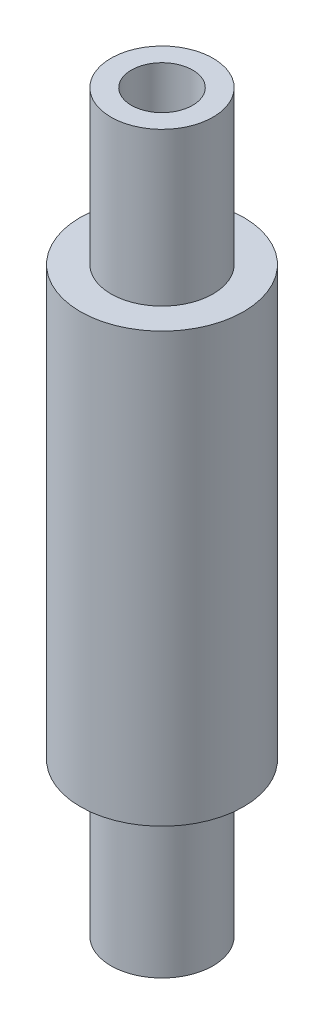
ISO-10303-21;
HEADER;
FILE_DESCRIPTION(('STEP AP214'),'2;1');
FILE_NAME('part.step','',(''),(''),'','','');
FILE_SCHEMA(('AUTOMOTIVE_DESIGN { 1 0 10303 214 1 1 1 1 }'));
ENDSEC;
DATA;
#1=APPLICATION_CONTEXT('core data for automotive mechanical design processes');
#2=APPLICATION_PROTOCOL_DEFINITION('international standard','automotive_design',2000,#1);
#3=PRODUCT_CONTEXT('',#1,'mechanical');
#4=PRODUCT('Part','Part','',(#3));
#5=PRODUCT_RELATED_PRODUCT_CATEGORY('part','',(#4));
#6=PRODUCT_DEFINITION_FORMATION('','',#4);
#7=PRODUCT_DEFINITION_CONTEXT('part definition',#1,'design');
#8=PRODUCT_DEFINITION('design','',#6,#7);
#9=PRODUCT_DEFINITION_SHAPE('','',#8);
#10=(LENGTH_UNIT() NAMED_UNIT(*) SI_UNIT(.MILLI.,.METRE.));
#11=(NAMED_UNIT(*) PLANE_ANGLE_UNIT() SI_UNIT($,.RADIAN.));
#12=(NAMED_UNIT(*) SI_UNIT($,.STERADIAN.) SOLID_ANGLE_UNIT());
#13=UNCERTAINTY_MEASURE_WITH_UNIT(LENGTH_MEASURE(1.E-05),#10,'distance_accuracy_value','');
#14=(GEOMETRIC_REPRESENTATION_CONTEXT(3) GLOBAL_UNCERTAINTY_ASSIGNED_CONTEXT((#13)) GLOBAL_UNIT_ASSIGNED_CONTEXT((#10,
#11,#12)) REPRESENTATION_CONTEXT('',''));
#15=CARTESIAN_POINT('',(0.,0.,0.));
#16=DIRECTION('',(0.,0.,1.));
#17=DIRECTION('',(1.,0.,0.));
#18=AXIS2_PLACEMENT_3D('',#15,#16,#17);
#19=CARTESIAN_POINT('',(0.,21.,0.));
#20=DIRECTION('',(0.,1.,0.));
#21=DIRECTION('',(0.,0.,1.));
#22=AXIS2_PLACEMENT_3D('',#19,#20,#21);
#23=PLANE('',#22);
#24=CARTESIAN_POINT('',(0.,21.,0.));
#25=DIRECTION('',(0.,1.,0.));
#26=DIRECTION('',(0.,0.,1.));
#27=AXIS2_PLACEMENT_3D('',#24,#25,#26);
#28=CIRCLE('',#27,2.5);
#29=CARTESIAN_POINT('',(0.,21.,2.5));
#30=VERTEX_POINT('',#29);
#31=EDGE_CURVE('E57',#30,#30,#28,.T.);
#32=ORIENTED_EDGE('',*,*,#31,.F.);
#33=EDGE_LOOP('',(#32));
#34=FACE_BOUND('',#33,.T.);
#35=CARTESIAN_POINT('',(0.,21.,0.));
#36=DIRECTION('',(0.,1.,0.));
#37=DIRECTION('',(0.,0.,1.));
#38=AXIS2_PLACEMENT_3D('',#35,#36,#37);
#39=CIRCLE('',#38,4.);
#40=CARTESIAN_POINT('',(0.,21.,4.));
#41=VERTEX_POINT('',#40);
#42=EDGE_CURVE('E43',#41,#41,#39,.T.);
#43=ORIENTED_EDGE('',*,*,#42,.T.);
#44=EDGE_LOOP('',(#43));
#45=FACE_BOUND('',#44,.T.);
#46=ADVANCED_FACE('F36',(#34,#45),#23,.T.);
#47=CARTESIAN_POINT('',(0.,0.,0.));
#48=DIRECTION('',(0.,1.,0.));
#49=DIRECTION('',(0.,0.,1.));
#50=AXIS2_PLACEMENT_3D('',#47,#48,#49);
#51=PLANE('',#50);
#52=CARTESIAN_POINT('',(0.,0.,0.));
#53=DIRECTION('',(0.,1.,0.));
#54=DIRECTION('',(0.,0.,1.));
#55=AXIS2_PLACEMENT_3D('',#52,#53,#54);
#56=CIRCLE('',#55,2.5);
#57=CARTESIAN_POINT('',(0.,0.,2.5));
#58=VERTEX_POINT('',#57);
#59=EDGE_CURVE('E10',#58,#58,#56,.F.);
#60=ORIENTED_EDGE('',*,*,#59,.F.);
#61=EDGE_LOOP('',(#60));
#62=FACE_BOUND('',#61,.T.);
#63=CARTESIAN_POINT('',(0.,0.,0.));
#64=DIRECTION('',(0.,1.,0.));
#65=DIRECTION('',(0.,0.,1.));
#66=AXIS2_PLACEMENT_3D('',#63,#64,#65);
#67=CIRCLE('',#66,4.);
#68=CARTESIAN_POINT('',(0.,0.,4.));
#69=VERTEX_POINT('',#68);
#70=EDGE_CURVE('E47',#69,#69,#67,.T.);
#71=ORIENTED_EDGE('',*,*,#70,.F.);
#72=EDGE_LOOP('',(#71));
#73=FACE_BOUND('',#72,.T.);
#74=ADVANCED_FACE('F91',(#62,#73),#51,.F.);
#75=CARTESIAN_POINT('',(0.,21.,0.));
#76=DIRECTION('',(0.,-1.,0.));
#77=DIRECTION('',(0.,0.,-1.));
#78=AXIS2_PLACEMENT_3D('',#75,#76,#77);
#79=CYLINDRICAL_SURFACE('',#78,4.);
#80=ORIENTED_EDGE('',*,*,#42,.F.);
#81=EDGE_LOOP('',(#80));
#82=FACE_BOUND('',#81,.T.);
#83=ORIENTED_EDGE('',*,*,#70,.T.);
#84=EDGE_LOOP('',(#83));
#85=FACE_BOUND('',#84,.T.);
#86=ADVANCED_FACE('F38',(#82,#85),#79,.T.);
#87=CARTESIAN_POINT('',(0.,-7.5,0.));
#88=DIRECTION('',(0.,1.,0.));
#89=DIRECTION('',(0.,0.,1.));
#90=AXIS2_PLACEMENT_3D('',#87,#88,#89);
#91=CYLINDRICAL_SURFACE('',#90,2.5);
#92=CARTESIAN_POINT('',(0.,-7.5,0.));
#93=DIRECTION('',(0.,-1.,0.));
#94=DIRECTION('',(0.,0.,-1.));
#95=AXIS2_PLACEMENT_3D('',#92,#93,#94);
#96=CIRCLE('',#95,2.5);
#97=CARTESIAN_POINT('',(0.,-7.5,-2.5));
#98=VERTEX_POINT('',#97);
#99=EDGE_CURVE('E52',#98,#98,#96,.T.);
#100=ORIENTED_EDGE('',*,*,#99,.F.);
#101=EDGE_LOOP('',(#100));
#102=FACE_BOUND('',#101,.T.);
#103=ORIENTED_EDGE('',*,*,#59,.T.);
#104=EDGE_LOOP('',(#103));
#105=FACE_BOUND('',#104,.T.);
#106=ADVANCED_FACE('F98',(#102,#105),#91,.T.);
#107=CARTESIAN_POINT('',(0.,-7.5,0.));
#108=DIRECTION('',(0.,-1.,0.));
#109=DIRECTION('',(0.,0.,-1.));
#110=AXIS2_PLACEMENT_3D('',#107,#108,#109);
#111=PLANE('',#110);
#112=CARTESIAN_POINT('',(0.,-7.5,0.));
#113=DIRECTION('',(0.,1.,0.));
#114=DIRECTION('',(0.,0.,1.));
#115=AXIS2_PLACEMENT_3D('',#112,#113,#114);
#116=CIRCLE('',#115,1.5);
#117=CARTESIAN_POINT('',(0.,-7.5,1.5));
#118=VERTEX_POINT('',#117);
#119=EDGE_CURVE('E60',#118,#118,#116,.T.);
#120=ORIENTED_EDGE('',*,*,#119,.T.);
#121=EDGE_LOOP('',(#120));
#122=FACE_BOUND('',#121,.T.);
#123=ORIENTED_EDGE('',*,*,#99,.T.);
#124=EDGE_LOOP('',(#123));
#125=FACE_BOUND('',#124,.T.);
#126=ADVANCED_FACE('F69',(#122,#125),#111,.T.);
#127=CARTESIAN_POINT('',(0.,28.5,0.));
#128=DIRECTION('',(0.,-1.,0.));
#129=DIRECTION('',(0.,0.,-1.));
#130=AXIS2_PLACEMENT_3D('',#127,#128,#129);
#131=CYLINDRICAL_SURFACE('',#130,2.5);
#132=CARTESIAN_POINT('',(0.,28.5,0.));
#133=DIRECTION('',(0.,1.,0.));
#134=DIRECTION('',(0.,0.,1.));
#135=AXIS2_PLACEMENT_3D('',#132,#133,#134);
#136=CIRCLE('',#135,2.5);
#137=CARTESIAN_POINT('',(0.,28.5,2.5));
#138=VERTEX_POINT('',#137);
#139=EDGE_CURVE('E56',#138,#138,#136,.T.);
#140=ORIENTED_EDGE('',*,*,#139,.F.);
#141=EDGE_LOOP('',(#140));
#142=FACE_BOUND('',#141,.T.);
#143=ORIENTED_EDGE('',*,*,#31,.T.);
#144=EDGE_LOOP('',(#143));
#145=FACE_BOUND('',#144,.T.);
#146=ADVANCED_FACE('F81',(#142,#145),#131,.T.);
#147=CARTESIAN_POINT('',(0.,28.5,0.));
#148=DIRECTION('',(0.,1.,0.));
#149=DIRECTION('',(0.,0.,1.));
#150=AXIS2_PLACEMENT_3D('',#147,#148,#149);
#151=PLANE('',#150);
#152=CARTESIAN_POINT('',(0.,28.5,0.));
#153=DIRECTION('',(0.,1.,0.));
#154=DIRECTION('',(0.,0.,1.));
#155=AXIS2_PLACEMENT_3D('',#152,#153,#154);
#156=CIRCLE('',#155,1.5);
#157=CARTESIAN_POINT('',(0.,28.5,1.5));
#158=VERTEX_POINT('',#157);
#159=EDGE_CURVE('E63',#158,#158,#156,.T.);
#160=ORIENTED_EDGE('',*,*,#159,.F.);
#161=EDGE_LOOP('',(#160));
#162=FACE_BOUND('',#161,.T.);
#163=ORIENTED_EDGE('',*,*,#139,.T.);
#164=EDGE_LOOP('',(#163));
#165=FACE_BOUND('',#164,.T.);
#166=ADVANCED_FACE('F75',(#162,#165),#151,.T.);
#167=CARTESIAN_POINT('',(0.,-7.5,0.));
#168=DIRECTION('',(0.,1.,0.));
#169=DIRECTION('',(0.,0.,1.));
#170=AXIS2_PLACEMENT_3D('',#167,#168,#169);
#171=CYLINDRICAL_SURFACE('',#170,1.5);
#172=ORIENTED_EDGE('',*,*,#119,.F.);
#173=EDGE_LOOP('',(#172));
#174=FACE_BOUND('',#173,.T.);
#175=ORIENTED_EDGE('',*,*,#159,.T.);
#176=EDGE_LOOP('',(#175));
#177=FACE_BOUND('',#176,.T.);
#178=ADVANCED_FACE('F72',(#174,#177),#171,.F.);
#179=CLOSED_SHELL('',(#46,#74,#86,#106,#126,#146,#166,#178));
#180=MANIFOLD_SOLID_BREP('B2',#179);
#181=ADVANCED_BREP_SHAPE_REPRESENTATION('',(#18,#180),#14);
#182=SHAPE_DEFINITION_REPRESENTATION(#9,#181);
ENDSEC;
END-ISO-10303-21;
